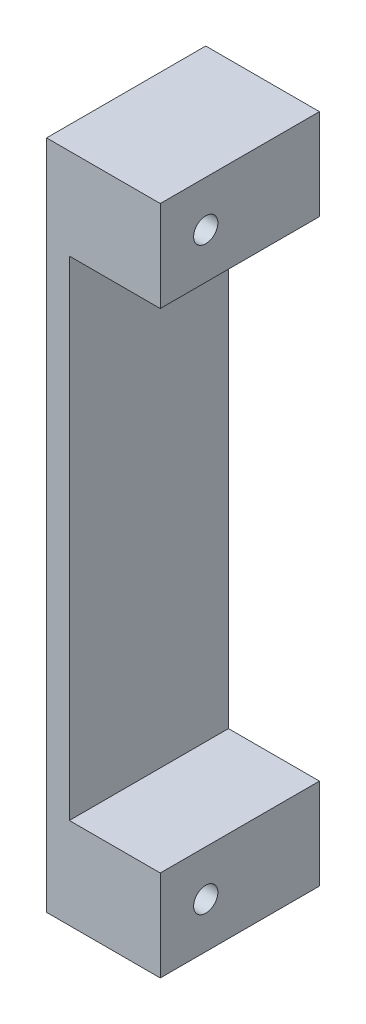
ISO-10303-21;
HEADER;
FILE_DESCRIPTION(('STEP AP214'),'2;1');
FILE_NAME('part.step','',(''),(''),'','','');
FILE_SCHEMA(('AUTOMOTIVE_DESIGN { 1 0 10303 214 1 1 1 1 }'));
ENDSEC;
DATA;
#1=APPLICATION_CONTEXT('core data for automotive mechanical design processes');
#2=APPLICATION_PROTOCOL_DEFINITION('international standard','automotive_design',2000,#1);
#3=PRODUCT_CONTEXT('',#1,'mechanical');
#4=PRODUCT('Part','Part','',(#3));
#5=PRODUCT_RELATED_PRODUCT_CATEGORY('part','',(#4));
#6=PRODUCT_DEFINITION_FORMATION('','',#4);
#7=PRODUCT_DEFINITION_CONTEXT('part definition',#1,'design');
#8=PRODUCT_DEFINITION('design','',#6,#7);
#9=PRODUCT_DEFINITION_SHAPE('','',#8);
#10=(LENGTH_UNIT() NAMED_UNIT(*) SI_UNIT(.MILLI.,.METRE.));
#11=(NAMED_UNIT(*) PLANE_ANGLE_UNIT() SI_UNIT($,.RADIAN.));
#12=(NAMED_UNIT(*) SI_UNIT($,.STERADIAN.) SOLID_ANGLE_UNIT());
#13=UNCERTAINTY_MEASURE_WITH_UNIT(LENGTH_MEASURE(1.E-05),#10,'distance_accuracy_value','');
#14=(GEOMETRIC_REPRESENTATION_CONTEXT(3) GLOBAL_UNCERTAINTY_ASSIGNED_CONTEXT((#13)) GLOBAL_UNIT_ASSIGNED_CONTEXT((#10,
#11,#12)) REPRESENTATION_CONTEXT('',''));
#15=CARTESIAN_POINT('',(0.,0.,0.));
#16=DIRECTION('',(0.,0.,1.));
#17=DIRECTION('',(1.,0.,0.));
#18=AXIS2_PLACEMENT_3D('',#15,#16,#17);
#19=CARTESIAN_POINT('',(12.7,0.,0.));
#20=DIRECTION('',(-1.,0.,0.));
#21=DIRECTION('',(0.,0.,1.));
#22=AXIS2_PLACEMENT_3D('',#19,#20,#21);
#23=PLANE('',#22);
#24=CARTESIAN_POINT('',(12.7,69.85,-5.08));
#25=DIRECTION('',(1.,0.,0.));
#26=DIRECTION('',(0.,0.,-1.));
#27=AXIS2_PLACEMENT_3D('',#24,#25,#26);
#28=CIRCLE('',#27,1.35254999999999);
#29=CARTESIAN_POINT('',(12.7,69.85,-6.43255));
#30=VERTEX_POINT('',#29);
#31=EDGE_CURVE('E229',#30,#30,#28,.T.);
#32=ORIENTED_EDGE('',*,*,#31,.F.);
#33=EDGE_LOOP('',(#32));
#34=FACE_BOUND('',#33,.T.);
#35=DIRECTION('',(0.,-1.,0.));
#36=VECTOR('',#35,1.);
#37=CARTESIAN_POINT('',(12.7,0.,0.));
#38=LINE('',#37,#36);
#39=CARTESIAN_POINT('',(12.7,74.93,0.));
#40=VERTEX_POINT('',#39);
#41=CARTESIAN_POINT('',(12.7,64.77,0.));
#42=VERTEX_POINT('',#41);
#43=EDGE_CURVE('E138',#40,#42,#38,.T.);
#44=ORIENTED_EDGE('',*,*,#43,.T.);
#45=DIRECTION('',(0.,0.,-1.));
#46=VECTOR('',#45,1.);
#47=CARTESIAN_POINT('',(12.7,64.77,0.));
#48=LINE('',#47,#46);
#49=CARTESIAN_POINT('',(12.7,64.77,-17.78));
#50=VERTEX_POINT('',#49);
#51=EDGE_CURVE('E44',#42,#50,#48,.T.);
#52=ORIENTED_EDGE('',*,*,#51,.T.);
#53=DIRECTION('',(0.,1.,0.));
#54=VECTOR('',#53,1.);
#55=CARTESIAN_POINT('',(12.7,0.,-17.78));
#56=LINE('',#55,#54);
#57=CARTESIAN_POINT('',(12.7,74.93,-17.78));
#58=VERTEX_POINT('',#57);
#59=EDGE_CURVE('E142',#50,#58,#56,.T.);
#60=ORIENTED_EDGE('',*,*,#59,.T.);
#61=DIRECTION('',(0.,0.,1.));
#62=VECTOR('',#61,1.);
#63=CARTESIAN_POINT('',(12.7,74.93,0.));
#64=LINE('',#63,#62);
#65=EDGE_CURVE('E60',#58,#40,#64,.T.);
#66=ORIENTED_EDGE('',*,*,#65,.T.);
#67=EDGE_LOOP('',(#44,#52,#60,#66));
#68=FACE_BOUND('',#67,.T.);
#69=ADVANCED_FACE('F36',(#34,#68),#23,.F.);
#70=CARTESIAN_POINT('',(12.7,0.,0.));
#71=DIRECTION('',(0.,0.,-1.));
#72=DIRECTION('',(-1.,0.,0.));
#73=AXIS2_PLACEMENT_3D('',#70,#71,#72);
#74=PLANE('',#73);
#75=DIRECTION('',(0.,-1.,0.));
#76=VECTOR('',#75,1.);
#77=CARTESIAN_POINT('',(2.54,64.77,0.));
#78=LINE('',#77,#76);
#79=CARTESIAN_POINT('',(2.54,64.77,0.));
#80=VERTEX_POINT('',#79);
#81=CARTESIAN_POINT('',(2.54,10.16,0.));
#82=VERTEX_POINT('',#81);
#83=EDGE_CURVE('E116',#80,#82,#78,.T.);
#84=ORIENTED_EDGE('',*,*,#83,.F.);
#85=DIRECTION('',(1.,0.,0.));
#86=VECTOR('',#85,1.);
#87=CARTESIAN_POINT('',(2.54,64.77,0.));
#88=LINE('',#87,#86);
#89=EDGE_CURVE('E127',#80,#42,#88,.T.);
#90=ORIENTED_EDGE('',*,*,#89,.T.);
#91=ORIENTED_EDGE('',*,*,#43,.F.);
#92=DIRECTION('',(-1.,0.,0.));
#93=VECTOR('',#92,1.);
#94=CARTESIAN_POINT('',(12.7,74.93,0.));
#95=LINE('',#94,#93);
#96=CARTESIAN_POINT('',(0.,74.93,0.));
#97=VERTEX_POINT('',#96);
#98=EDGE_CURVE('E147',#40,#97,#95,.T.);
#99=ORIENTED_EDGE('',*,*,#98,.T.);
#100=DIRECTION('',(0.,-1.,0.));
#101=VECTOR('',#100,1.);
#102=CARTESIAN_POINT('',(0.,0.,0.));
#103=LINE('',#102,#101);
#104=CARTESIAN_POINT('',(0.,0.,0.));
#105=VERTEX_POINT('',#104);
#106=EDGE_CURVE('E137',#97,#105,#103,.T.);
#107=ORIENTED_EDGE('',*,*,#106,.T.);
#108=DIRECTION('',(-1.,0.,0.));
#109=VECTOR('',#108,1.);
#110=CARTESIAN_POINT('',(12.7,0.,0.));
#111=LINE('',#110,#109);
#112=CARTESIAN_POINT('',(12.7,0.,0.));
#113=VERTEX_POINT('',#112);
#114=EDGE_CURVE('E161',#113,#105,#111,.T.);
#115=ORIENTED_EDGE('',*,*,#114,.F.);
#116=CARTESIAN_POINT('',(12.7,10.16,0.));
#117=VERTEX_POINT('',#116);
#118=EDGE_CURVE('E88',#117,#113,#38,.T.);
#119=ORIENTED_EDGE('',*,*,#118,.F.);
#120=DIRECTION('',(1.,0.,0.));
#121=VECTOR('',#120,1.);
#122=CARTESIAN_POINT('',(2.54,10.16,0.));
#123=LINE('',#122,#121);
#124=EDGE_CURVE('E51',#82,#117,#123,.T.);
#125=ORIENTED_EDGE('',*,*,#124,.F.);
#126=EDGE_LOOP('',(#84,#90,#91,#99,#107,#115,#119,#125));
#127=FACE_BOUND('',#126,.T.);
#128=ADVANCED_FACE('F38',(#127),#74,.F.);
#129=CARTESIAN_POINT('',(12.7,0.,0.));
#130=DIRECTION('',(0.,1.,0.));
#131=DIRECTION('',(0.,0.,1.));
#132=AXIS2_PLACEMENT_3D('',#129,#130,#131);
#133=PLANE('',#132);
#134=DIRECTION('',(0.,0.,-1.));
#135=VECTOR('',#134,1.);
#136=CARTESIAN_POINT('',(0.,0.,0.));
#137=LINE('',#136,#135);
#138=CARTESIAN_POINT('',(0.,0.,-17.78));
#139=VERTEX_POINT('',#138);
#140=EDGE_CURVE('E150',#105,#139,#137,.T.);
#141=ORIENTED_EDGE('',*,*,#140,.T.);
#142=DIRECTION('',(-1.,0.,0.));
#143=VECTOR('',#142,1.);
#144=CARTESIAN_POINT('',(12.7,0.,-17.78));
#145=LINE('',#144,#143);
#146=CARTESIAN_POINT('',(12.7,0.,-17.78));
#147=VERTEX_POINT('',#146);
#148=EDGE_CURVE('E158',#147,#139,#145,.T.);
#149=ORIENTED_EDGE('',*,*,#148,.F.);
#150=DIRECTION('',(0.,0.,-1.));
#151=VECTOR('',#150,1.);
#152=CARTESIAN_POINT('',(12.7,0.,0.));
#153=LINE('',#152,#151);
#154=EDGE_CURVE('E140',#113,#147,#153,.T.);
#155=ORIENTED_EDGE('',*,*,#154,.F.);
#156=ORIENTED_EDGE('',*,*,#114,.T.);
#157=EDGE_LOOP('',(#141,#149,#155,#156));
#158=FACE_BOUND('',#157,.T.);
#159=ADVANCED_FACE('F191',(#158),#133,.F.);
#160=CARTESIAN_POINT('',(12.7,0.,-17.78));
#161=DIRECTION('',(0.,0.,1.));
#162=DIRECTION('',(1.,0.,0.));
#163=AXIS2_PLACEMENT_3D('',#160,#161,#162);
#164=PLANE('',#163);
#165=CARTESIAN_POINT('',(6.35,5.08,-17.78));
#166=DIRECTION('',(0.,0.,-1.));
#167=DIRECTION('',(1.,0.,0.));
#168=AXIS2_PLACEMENT_3D('',#165,#166,#167);
#169=CIRCLE('',#168,2.36855);
#170=CARTESIAN_POINT('',(8.71855,5.08,-17.78));
#171=VERTEX_POINT('',#170);
#172=EDGE_CURVE('E220',#171,#171,#169,.T.);
#173=ORIENTED_EDGE('',*,*,#172,.F.);
#174=EDGE_LOOP('',(#173));
#175=FACE_BOUND('',#174,.T.);
#176=CARTESIAN_POINT('',(6.35,69.85,-17.78));
#177=DIRECTION('',(0.,0.,-1.));
#178=DIRECTION('',(-1.,0.,0.));
#179=AXIS2_PLACEMENT_3D('',#176,#177,#178);
#180=CIRCLE('',#179,2.36855);
#181=CARTESIAN_POINT('',(3.98145,69.85,-17.78));
#182=VERTEX_POINT('',#181);
#183=EDGE_CURVE('E223',#182,#182,#180,.T.);
#184=ORIENTED_EDGE('',*,*,#183,.F.);
#185=EDGE_LOOP('',(#184));
#186=FACE_BOUND('',#185,.T.);
#187=ORIENTED_EDGE('',*,*,#59,.F.);
#188=DIRECTION('',(-1.,0.,0.));
#189=VECTOR('',#188,1.);
#190=CARTESIAN_POINT('',(12.7,64.77,-17.78));
#191=LINE('',#190,#189);
#192=CARTESIAN_POINT('',(2.54,64.77,-17.78));
#193=VERTEX_POINT('',#192);
#194=EDGE_CURVE('E134',#50,#193,#191,.T.);
#195=ORIENTED_EDGE('',*,*,#194,.T.);
#196=DIRECTION('',(0.,1.,0.));
#197=VECTOR('',#196,1.);
#198=CARTESIAN_POINT('',(2.54,0.,-17.78));
#199=LINE('',#198,#197);
#200=CARTESIAN_POINT('',(2.54,10.16,-17.78));
#201=VERTEX_POINT('',#200);
#202=EDGE_CURVE('E11',#201,#193,#199,.T.);
#203=ORIENTED_EDGE('',*,*,#202,.F.);
#204=DIRECTION('',(1.,0.,0.));
#205=VECTOR('',#204,1.);
#206=CARTESIAN_POINT('',(12.7,10.16,-17.78));
#207=LINE('',#206,#205);
#208=CARTESIAN_POINT('',(12.7,10.16,-17.78));
#209=VERTEX_POINT('',#208);
#210=EDGE_CURVE('E112',#201,#209,#207,.T.);
#211=ORIENTED_EDGE('',*,*,#210,.T.);
#212=EDGE_CURVE('E143',#147,#209,#56,.T.);
#213=ORIENTED_EDGE('',*,*,#212,.F.);
#214=ORIENTED_EDGE('',*,*,#148,.T.);
#215=DIRECTION('',(0.,1.,0.));
#216=VECTOR('',#215,1.);
#217=CARTESIAN_POINT('',(0.,0.,-17.78));
#218=LINE('',#217,#216);
#219=CARTESIAN_POINT('',(0.,74.93,-17.78));
#220=VERTEX_POINT('',#219);
#221=EDGE_CURVE('E152',#139,#220,#218,.T.);
#222=ORIENTED_EDGE('',*,*,#221,.T.);
#223=DIRECTION('',(-1.,0.,0.));
#224=VECTOR('',#223,1.);
#225=CARTESIAN_POINT('',(12.7,74.93,-17.78));
#226=LINE('',#225,#224);
#227=EDGE_CURVE('E156',#58,#220,#226,.T.);
#228=ORIENTED_EDGE('',*,*,#227,.F.);
#229=EDGE_LOOP('',(#187,#195,#203,#211,#213,#214,#222,#228));
#230=FACE_BOUND('',#229,.T.);
#231=ADVANCED_FACE('F169',(#175,#186,#230),#164,.F.);
#232=CARTESIAN_POINT('',(12.7,74.93,0.));
#233=DIRECTION('',(0.,-1.,0.));
#234=DIRECTION('',(0.,0.,-1.));
#235=AXIS2_PLACEMENT_3D('',#232,#233,#234);
#236=PLANE('',#235);
#237=DIRECTION('',(0.,0.,1.));
#238=VECTOR('',#237,1.);
#239=CARTESIAN_POINT('',(0.,74.93,0.));
#240=LINE('',#239,#238);
#241=EDGE_CURVE('E81',#220,#97,#240,.T.);
#242=ORIENTED_EDGE('',*,*,#241,.T.);
#243=ORIENTED_EDGE('',*,*,#98,.F.);
#244=ORIENTED_EDGE('',*,*,#65,.F.);
#245=ORIENTED_EDGE('',*,*,#227,.T.);
#246=EDGE_LOOP('',(#242,#243,#244,#245));
#247=FACE_BOUND('',#246,.T.);
#248=ADVANCED_FACE('F171',(#247),#236,.F.);
#249=CARTESIAN_POINT('',(12.7,5.08,-5.08));
#250=DIRECTION('',(1.,0.,0.));
#251=DIRECTION('',(0.,0.,-1.));
#252=AXIS2_PLACEMENT_3D('',#249,#250,#251);
#253=CIRCLE('',#252,1.35255);
#254=CARTESIAN_POINT('',(12.7,5.08,-6.43255));
#255=VERTEX_POINT('',#254);
#256=EDGE_CURVE('E204',#255,#255,#253,.T.);
#257=ORIENTED_EDGE('',*,*,#256,.F.);
#258=EDGE_LOOP('',(#257));
#259=FACE_BOUND('',#258,.T.);
#260=ORIENTED_EDGE('',*,*,#212,.T.);
#261=DIRECTION('',(0.,0.,-1.));
#262=VECTOR('',#261,1.);
#263=CARTESIAN_POINT('',(12.7,10.16,-13.97));
#264=LINE('',#263,#262);
#265=EDGE_CURVE('E124',#117,#209,#264,.T.);
#266=ORIENTED_EDGE('',*,*,#265,.F.);
#267=ORIENTED_EDGE('',*,*,#118,.T.);
#268=ORIENTED_EDGE('',*,*,#154,.T.);
#269=EDGE_LOOP('',(#260,#266,#267,#268));
#270=FACE_BOUND('',#269,.T.);
#271=ADVANCED_FACE('F187',(#259,#270),#23,.F.);
#272=CARTESIAN_POINT('',(0.,0.,0.));
#273=DIRECTION('',(-1.,0.,0.));
#274=DIRECTION('',(0.,0.,1.));
#275=AXIS2_PLACEMENT_3D('',#272,#273,#274);
#276=PLANE('',#275);
#277=CARTESIAN_POINT('',(0.,69.85,-5.08));
#278=DIRECTION('',(1.,0.,0.));
#279=DIRECTION('',(0.,0.,-1.));
#280=AXIS2_PLACEMENT_3D('',#277,#278,#279);
#281=CIRCLE('',#280,1.35254999999999);
#282=CARTESIAN_POINT('',(0.,69.85,-6.43255));
#283=VERTEX_POINT('',#282);
#284=EDGE_CURVE('E237',#283,#283,#281,.T.);
#285=ORIENTED_EDGE('',*,*,#284,.T.);
#286=EDGE_LOOP('',(#285));
#287=FACE_BOUND('',#286,.T.);
#288=CARTESIAN_POINT('',(0.,5.08,-5.08));
#289=DIRECTION('',(1.,0.,0.));
#290=DIRECTION('',(0.,0.,-1.));
#291=AXIS2_PLACEMENT_3D('',#288,#289,#290);
#292=CIRCLE('',#291,1.35255);
#293=CARTESIAN_POINT('',(0.,5.08,-6.43255));
#294=VERTEX_POINT('',#293);
#295=EDGE_CURVE('E241',#294,#294,#292,.T.);
#296=ORIENTED_EDGE('',*,*,#295,.T.);
#297=EDGE_LOOP('',(#296));
#298=FACE_BOUND('',#297,.T.);
#299=ORIENTED_EDGE('',*,*,#106,.F.);
#300=ORIENTED_EDGE('',*,*,#241,.F.);
#301=ORIENTED_EDGE('',*,*,#221,.F.);
#302=ORIENTED_EDGE('',*,*,#140,.F.);
#303=EDGE_LOOP('',(#299,#300,#301,#302));
#304=FACE_BOUND('',#303,.T.);
#305=ADVANCED_FACE('F182',(#287,#298,#304),#276,.T.);
#306=CARTESIAN_POINT('',(2.54,0.,0.));
#307=DIRECTION('',(1.,0.,0.));
#308=DIRECTION('',(0.,0.,-1.));
#309=AXIS2_PLACEMENT_3D('',#306,#307,#308);
#310=PLANE('',#309);
#311=ORIENTED_EDGE('',*,*,#202,.T.);
#312=DIRECTION('',(0.,0.,1.));
#313=VECTOR('',#312,1.);
#314=CARTESIAN_POINT('',(2.54,64.77,-13.97));
#315=LINE('',#314,#313);
#316=EDGE_CURVE('E115',#193,#80,#315,.T.);
#317=ORIENTED_EDGE('',*,*,#316,.T.);
#318=ORIENTED_EDGE('',*,*,#83,.T.);
#319=DIRECTION('',(0.,0.,-1.));
#320=VECTOR('',#319,1.);
#321=CARTESIAN_POINT('',(2.54,10.16,0.));
#322=LINE('',#321,#320);
#323=EDGE_CURVE('E108',#82,#201,#322,.T.);
#324=ORIENTED_EDGE('',*,*,#323,.T.);
#325=EDGE_LOOP('',(#311,#317,#318,#324));
#326=FACE_BOUND('',#325,.T.);
#327=ADVANCED_FACE('F119',(#326),#310,.T.);
#328=CARTESIAN_POINT('',(2.54,64.77,0.));
#329=DIRECTION('',(0.,1.,0.));
#330=DIRECTION('',(0.,0.,1.));
#331=AXIS2_PLACEMENT_3D('',#328,#329,#330);
#332=PLANE('',#331);
#333=ORIENTED_EDGE('',*,*,#51,.F.);
#334=ORIENTED_EDGE('',*,*,#89,.F.);
#335=ORIENTED_EDGE('',*,*,#316,.F.);
#336=ORIENTED_EDGE('',*,*,#194,.F.);
#337=EDGE_LOOP('',(#333,#334,#335,#336));
#338=FACE_BOUND('',#337,.T.);
#339=ADVANCED_FACE('F173',(#338),#332,.F.);
#340=CARTESIAN_POINT('',(2.54,10.16,-13.97));
#341=DIRECTION('',(0.,-1.,0.));
#342=DIRECTION('',(0.,0.,-1.));
#343=AXIS2_PLACEMENT_3D('',#340,#341,#342);
#344=PLANE('',#343);
#345=ORIENTED_EDGE('',*,*,#323,.F.);
#346=ORIENTED_EDGE('',*,*,#124,.T.);
#347=ORIENTED_EDGE('',*,*,#265,.T.);
#348=ORIENTED_EDGE('',*,*,#210,.F.);
#349=EDGE_LOOP('',(#345,#346,#347,#348));
#350=FACE_BOUND('',#349,.T.);
#351=ADVANCED_FACE('F110',(#350),#344,.F.);
#352=CARTESIAN_POINT('',(12.7,5.08,-5.08));
#353=DIRECTION('',(1.,0.,0.));
#354=DIRECTION('',(0.,0.,-1.));
#355=AXIS2_PLACEMENT_3D('',#352,#353,#354);
#356=CYLINDRICAL_SURFACE('',#355,1.35255);
#357=ORIENTED_EDGE('',*,*,#295,.F.);
#358=EDGE_LOOP('',(#357));
#359=FACE_BOUND('',#358,.T.);
#360=ORIENTED_EDGE('',*,*,#256,.T.);
#361=EDGE_LOOP('',(#360));
#362=FACE_BOUND('',#361,.T.);
#363=ADVANCED_FACE('F180',(#359,#362),#356,.F.);
#364=CARTESIAN_POINT('',(12.7,69.85,-5.08));
#365=DIRECTION('',(1.,0.,0.));
#366=DIRECTION('',(0.,0.,-1.));
#367=AXIS2_PLACEMENT_3D('',#364,#365,#366);
#368=CYLINDRICAL_SURFACE('',#367,1.35254999999999);
#369=ORIENTED_EDGE('',*,*,#284,.F.);
#370=EDGE_LOOP('',(#369));
#371=FACE_BOUND('',#370,.T.);
#372=ORIENTED_EDGE('',*,*,#31,.T.);
#373=EDGE_LOOP('',(#372));
#374=FACE_BOUND('',#373,.T.);
#375=ADVANCED_FACE('F248',(#371,#374),#368,.F.);
#376=CARTESIAN_POINT('',(6.35,69.85,-6.6675));
#377=DIRECTION('',(0.,0.,-1.));
#378=DIRECTION('',(-1.,0.,0.));
#379=AXIS2_PLACEMENT_3D('',#376,#377,#378);
#380=CYLINDRICAL_SURFACE('',#379,2.36855);
#381=CARTESIAN_POINT('',(6.35,69.85,-6.6675));
#382=DIRECTION('',(0.,0.,-1.));
#383=DIRECTION('',(-1.,0.,0.));
#384=AXIS2_PLACEMENT_3D('',#381,#382,#383);
#385=CIRCLE('',#384,2.36855);
#386=CARTESIAN_POINT('',(3.98145,69.85,-6.6675));
#387=VERTEX_POINT('',#386);
#388=EDGE_CURVE('E225',#387,#387,#385,.T.);
#389=ORIENTED_EDGE('',*,*,#388,.F.);
#390=EDGE_LOOP('',(#389));
#391=FACE_BOUND('',#390,.T.);
#392=ORIENTED_EDGE('',*,*,#183,.T.);
#393=EDGE_LOOP('',(#392));
#394=FACE_BOUND('',#393,.T.);
#395=ADVANCED_FACE('F253',(#391,#394),#380,.F.);
#396=CARTESIAN_POINT('',(6.35,69.85,-6.6675));
#397=DIRECTION('',(0.,0.,-1.));
#398=DIRECTION('',(-1.,0.,0.));
#399=AXIS2_PLACEMENT_3D('',#396,#397,#398);
#400=PLANE('',#399);
#401=ORIENTED_EDGE('',*,*,#388,.T.);
#402=EDGE_LOOP('',(#401));
#403=FACE_BOUND('',#402,.T.);
#404=ADVANCED_FACE('F259',(#403),#400,.T.);
#405=CARTESIAN_POINT('',(6.35,5.08,-6.6675));
#406=DIRECTION('',(0.,0.,-1.));
#407=DIRECTION('',(-1.,0.,0.));
#408=AXIS2_PLACEMENT_3D('',#405,#406,#407);
#409=CYLINDRICAL_SURFACE('',#408,2.36855);
#410=CARTESIAN_POINT('',(6.35,5.08,-6.6675));
#411=DIRECTION('',(0.,0.,-1.));
#412=DIRECTION('',(1.,0.,0.));
#413=AXIS2_PLACEMENT_3D('',#410,#411,#412);
#414=CIRCLE('',#413,2.36855);
#415=CARTESIAN_POINT('',(8.71855,5.08,-6.6675));
#416=VERTEX_POINT('',#415);
#417=EDGE_CURVE('E226',#416,#416,#414,.T.);
#418=ORIENTED_EDGE('',*,*,#417,.F.);
#419=EDGE_LOOP('',(#418));
#420=FACE_BOUND('',#419,.T.);
#421=ORIENTED_EDGE('',*,*,#172,.T.);
#422=EDGE_LOOP('',(#421));
#423=FACE_BOUND('',#422,.T.);
#424=ADVANCED_FACE('F263',(#420,#423),#409,.F.);
#425=CARTESIAN_POINT('',(6.35,5.08,-6.6675));
#426=DIRECTION('',(0.,0.,1.));
#427=DIRECTION('',(1.,0.,0.));
#428=AXIS2_PLACEMENT_3D('',#425,#426,#427);
#429=PLANE('',#428);
#430=ORIENTED_EDGE('',*,*,#417,.T.);
#431=EDGE_LOOP('',(#430));
#432=FACE_BOUND('',#431,.T.);
#433=ADVANCED_FACE('F267',(#432),#429,.F.);
#434=CLOSED_SHELL('',(#69,#128,#159,#231,#248,#271,#305,#327,#339,#351,#363,#375,#395,#404,#424,#433));
#435=MANIFOLD_SOLID_BREP('B2',#434);
#436=ADVANCED_BREP_SHAPE_REPRESENTATION('',(#18,#435),#14);
#437=SHAPE_DEFINITION_REPRESENTATION(#9,#436);
ENDSEC;
END-ISO-10303-21;
